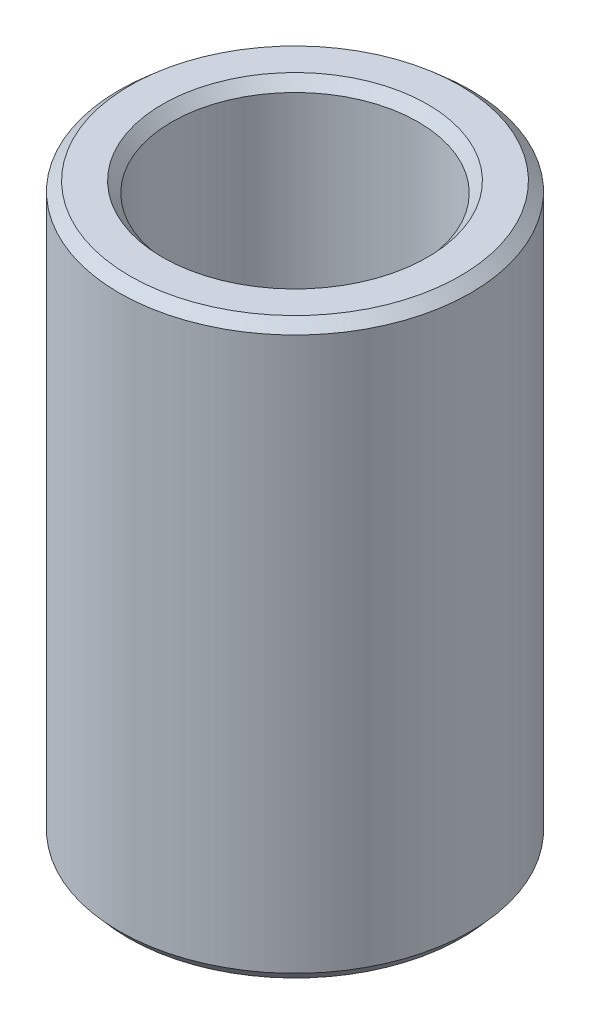
ISO-10303-21;
HEADER;
FILE_DESCRIPTION(('STEP AP214'),'2;1');
FILE_NAME('part.step','',(''),(''),'','','');
FILE_SCHEMA(('AUTOMOTIVE_DESIGN { 1 0 10303 214 1 1 1 1 }'));
ENDSEC;
DATA;
#1=APPLICATION_CONTEXT('core data for automotive mechanical design processes');
#2=APPLICATION_PROTOCOL_DEFINITION('international standard','automotive_design',2000,#1);
#3=PRODUCT_CONTEXT('',#1,'mechanical');
#4=PRODUCT('Part','Part','',(#3));
#5=PRODUCT_RELATED_PRODUCT_CATEGORY('part','',(#4));
#6=PRODUCT_DEFINITION_FORMATION('','',#4);
#7=PRODUCT_DEFINITION_CONTEXT('part definition',#1,'design');
#8=PRODUCT_DEFINITION('design','',#6,#7);
#9=PRODUCT_DEFINITION_SHAPE('','',#8);
#10=(LENGTH_UNIT() NAMED_UNIT(*) SI_UNIT(.MILLI.,.METRE.));
#11=(NAMED_UNIT(*) PLANE_ANGLE_UNIT() SI_UNIT($,.RADIAN.));
#12=(NAMED_UNIT(*) SI_UNIT($,.STERADIAN.) SOLID_ANGLE_UNIT());
#13=UNCERTAINTY_MEASURE_WITH_UNIT(LENGTH_MEASURE(1.E-05),#10,'distance_accuracy_value','');
#14=(GEOMETRIC_REPRESENTATION_CONTEXT(3) GLOBAL_UNCERTAINTY_ASSIGNED_CONTEXT((#13)) GLOBAL_UNIT_ASSIGNED_CONTEXT((#10,
#11,#12)) REPRESENTATION_CONTEXT('',''));
#15=CARTESIAN_POINT('',(0.,0.,0.));
#16=DIRECTION('',(0.,0.,1.));
#17=DIRECTION('',(1.,0.,0.));
#18=AXIS2_PLACEMENT_3D('',#15,#16,#17);
#19=CARTESIAN_POINT('',(0.,138.522134954012,0.));
#20=DIRECTION('',(0.,-1.,0.));
#21=DIRECTION('',(0.,0.,-1.));
#22=AXIS2_PLACEMENT_3D('',#19,#20,#21);
#23=CYLINDRICAL_SURFACE('',#22,42.5);
#24=CARTESIAN_POINT('',(0.,2.574633483614,0.));
#25=DIRECTION('',(0.,1.,0.));
#26=DIRECTION('',(0.,0.,1.));
#27=AXIS2_PLACEMENT_3D('',#24,#25,#26);
#28=CIRCLE('',#27,42.5);
#29=CARTESIAN_POINT('',(0.,2.574633483614,42.5));
#30=VERTEX_POINT('',#29);
#31=EDGE_CURVE('E10',#30,#30,#28,.T.);
#32=ORIENTED_EDGE('',*,*,#31,.T.);
#33=EDGE_LOOP('',(#32));
#34=FACE_BOUND('',#33,.T.);
#35=CARTESIAN_POINT('',(0.,136.26262318691,0.));
#36=DIRECTION('',(0.,1.,0.));
#37=DIRECTION('',(0.,0.,1.));
#38=AXIS2_PLACEMENT_3D('',#35,#36,#37);
#39=CIRCLE('',#38,42.5);
#40=CARTESIAN_POINT('',(0.,136.26262318691,42.5));
#41=VERTEX_POINT('',#40);
#42=EDGE_CURVE('E50',#41,#41,#39,.F.);
#43=ORIENTED_EDGE('',*,*,#42,.T.);
#44=EDGE_LOOP('',(#43));
#45=FACE_BOUND('',#44,.T.);
#46=ADVANCED_FACE('F39',(#34,#45),#23,.T.);
#47=CARTESIAN_POINT('',(0.,138.522134954012,0.));
#48=DIRECTION('',(0.,1.,0.));
#49=DIRECTION('',(0.,0.,1.));
#50=AXIS2_PLACEMENT_3D('',#47,#48,#49);
#51=PLANE('',#50);
#52=CARTESIAN_POINT('',(0.,138.522134954012,0.));
#53=DIRECTION('',(0.,1.,0.));
#54=DIRECTION('',(0.,0.,1.));
#55=AXIS2_PLACEMENT_3D('',#52,#53,#54);
#56=CIRCLE('',#55,32.0568829728244);
#57=CARTESIAN_POINT('',(0.,138.522134954012,32.0568829728244));
#58=VERTEX_POINT('',#57);
#59=EDGE_CURVE('E58',#58,#58,#56,.F.);
#60=ORIENTED_EDGE('',*,*,#59,.T.);
#61=EDGE_LOOP('',(#60));
#62=FACE_BOUND('',#61,.T.);
#63=CARTESIAN_POINT('',(0.,138.522134954012,0.));
#64=DIRECTION('',(0.,1.,0.));
#65=DIRECTION('',(0.,0.,1.));
#66=AXIS2_PLACEMENT_3D('',#63,#64,#65);
#67=CIRCLE('',#66,39.925366516386);
#68=CARTESIAN_POINT('',(0.,138.522134954012,39.925366516386));
#69=VERTEX_POINT('',#68);
#70=EDGE_CURVE('E61',#69,#69,#67,.T.);
#71=ORIENTED_EDGE('',*,*,#70,.T.);
#72=EDGE_LOOP('',(#71));
#73=FACE_BOUND('',#72,.T.);
#74=ADVANCED_FACE('F88',(#62,#73),#51,.T.);
#75=CARTESIAN_POINT('',(0.,0.,0.));
#76=DIRECTION('',(0.,1.,0.));
#77=DIRECTION('',(0.,0.,1.));
#78=AXIS2_PLACEMENT_3D('',#75,#76,#77);
#79=PLANE('',#78);
#80=CARTESIAN_POINT('',(0.,0.,0.));
#81=DIRECTION('',(0.,1.,0.));
#82=DIRECTION('',(0.,0.,1.));
#83=AXIS2_PLACEMENT_3D('',#80,#81,#82);
#84=CIRCLE('',#83,32.3720046893365);
#85=CARTESIAN_POINT('',(0.,0.,32.3720046893365));
#86=VERTEX_POINT('',#85);
#87=EDGE_CURVE('E51',#86,#86,#84,.T.);
#88=ORIENTED_EDGE('',*,*,#87,.T.);
#89=EDGE_LOOP('',(#88));
#90=FACE_BOUND('',#89,.T.);
#91=CARTESIAN_POINT('',(0.,0.,0.));
#92=DIRECTION('',(0.,1.,0.));
#93=DIRECTION('',(0.,0.,1.));
#94=AXIS2_PLACEMENT_3D('',#91,#92,#93);
#95=CIRCLE('',#94,40.240488232898);
#96=CARTESIAN_POINT('',(0.,0.,40.240488232898));
#97=VERTEX_POINT('',#96);
#98=EDGE_CURVE('E54',#97,#97,#95,.F.);
#99=ORIENTED_EDGE('',*,*,#98,.T.);
#100=EDGE_LOOP('',(#99));
#101=FACE_BOUND('',#100,.T.);
#102=ADVANCED_FACE('F83',(#90,#101),#79,.F.);
#103=CARTESIAN_POINT('',(0.,138.522134954012,0.));
#104=DIRECTION('',(0.,-1.,0.));
#105=DIRECTION('',(0.,0.,-1.));
#106=AXIS2_PLACEMENT_3D('',#103,#104,#105);
#107=CYLINDRICAL_SURFACE('',#106,29.7973712057225);
#108=CARTESIAN_POINT('',(0.,135.947501470398,0.));
#109=DIRECTION('',(0.,1.,0.));
#110=DIRECTION('',(0.,0.,1.));
#111=AXIS2_PLACEMENT_3D('',#108,#109,#110);
#112=CIRCLE('',#111,29.7973712057225);
#113=CARTESIAN_POINT('',(0.,135.947501470398,29.7973712057225));
#114=VERTEX_POINT('',#113);
#115=EDGE_CURVE('E67',#114,#114,#112,.T.);
#116=ORIENTED_EDGE('',*,*,#115,.T.);
#117=EDGE_LOOP('',(#116));
#118=FACE_BOUND('',#117,.T.);
#119=CARTESIAN_POINT('',(0.,2.25951176710193,0.));
#120=DIRECTION('',(0.,1.,0.));
#121=DIRECTION('',(0.,0.,1.));
#122=AXIS2_PLACEMENT_3D('',#119,#120,#121);
#123=CIRCLE('',#122,29.7973712057225);
#124=CARTESIAN_POINT('',(0.,2.25951176710193,29.7973712057225));
#125=VERTEX_POINT('',#124);
#126=EDGE_CURVE('E69',#125,#125,#123,.F.);
#127=ORIENTED_EDGE('',*,*,#126,.T.);
#128=EDGE_LOOP('',(#127));
#129=FACE_BOUND('',#128,.T.);
#130=ADVANCED_FACE('F71',(#118,#129),#107,.F.);
#131=CARTESIAN_POINT('',(0.,135.947501470398,0.));
#132=DIRECTION('',(0.,1.,0.));
#133=DIRECTION('',(0.,0.,1.));
#134=AXIS2_PLACEMENT_3D('',#131,#132,#133);
#135=CONICAL_SURFACE('',#134,29.7973712057225,0.720303614936882);
#136=ORIENTED_EDGE('',*,*,#59,.F.);
#137=EDGE_LOOP('',(#136));
#138=FACE_BOUND('',#137,.T.);
#139=ORIENTED_EDGE('',*,*,#115,.F.);
#140=EDGE_LOOP('',(#139));
#141=FACE_BOUND('',#140,.T.);
#142=ADVANCED_FACE('F77',(#138,#141),#135,.F.);
#143=CARTESIAN_POINT('',(0.,0.,0.));
#144=DIRECTION('',(0.,-1.,0.));
#145=DIRECTION('',(0.,0.,-1.));
#146=AXIS2_PLACEMENT_3D('',#143,#144,#145);
#147=CONICAL_SURFACE('',#146,32.3720046893365,0.850492711858015);
#148=ORIENTED_EDGE('',*,*,#126,.F.);
#149=EDGE_LOOP('',(#148));
#150=FACE_BOUND('',#149,.T.);
#151=ORIENTED_EDGE('',*,*,#87,.F.);
#152=EDGE_LOOP('',(#151));
#153=FACE_BOUND('',#152,.T.);
#154=ADVANCED_FACE('F73',(#150,#153),#147,.F.);
#155=CARTESIAN_POINT('',(0.,2.574633483614,0.));
#156=DIRECTION('',(0.,1.,0.));
#157=DIRECTION('',(0.,0.,1.));
#158=AXIS2_PLACEMENT_3D('',#155,#156,#157);
#159=CONICAL_SURFACE('',#158,42.5,0.720303614936888);
#160=ORIENTED_EDGE('',*,*,#98,.F.);
#161=EDGE_LOOP('',(#160));
#162=FACE_BOUND('',#161,.T.);
#163=ORIENTED_EDGE('',*,*,#31,.F.);
#164=EDGE_LOOP('',(#163));
#165=FACE_BOUND('',#164,.T.);
#166=ADVANCED_FACE('F76',(#162,#165),#159,.T.);
#167=CARTESIAN_POINT('',(0.,138.522134954012,0.));
#168=DIRECTION('',(0.,-1.,0.));
#169=DIRECTION('',(0.,0.,-1.));
#170=AXIS2_PLACEMENT_3D('',#167,#168,#169);
#171=CONICAL_SURFACE('',#170,39.925366516386,0.850492711858013);
#172=ORIENTED_EDGE('',*,*,#42,.F.);
#173=EDGE_LOOP('',(#172));
#174=FACE_BOUND('',#173,.T.);
#175=ORIENTED_EDGE('',*,*,#70,.F.);
#176=EDGE_LOOP('',(#175));
#177=FACE_BOUND('',#176,.T.);
#178=ADVANCED_FACE('F45',(#174,#177),#171,.T.);
#179=CLOSED_SHELL('',(#46,#74,#102,#130,#142,#154,#166,#178));
#180=MANIFOLD_SOLID_BREP('B2',#179);
#181=ADVANCED_BREP_SHAPE_REPRESENTATION('',(#18,#180),#14);
#182=SHAPE_DEFINITION_REPRESENTATION(#9,#181);
ENDSEC;
END-ISO-10303-21;
